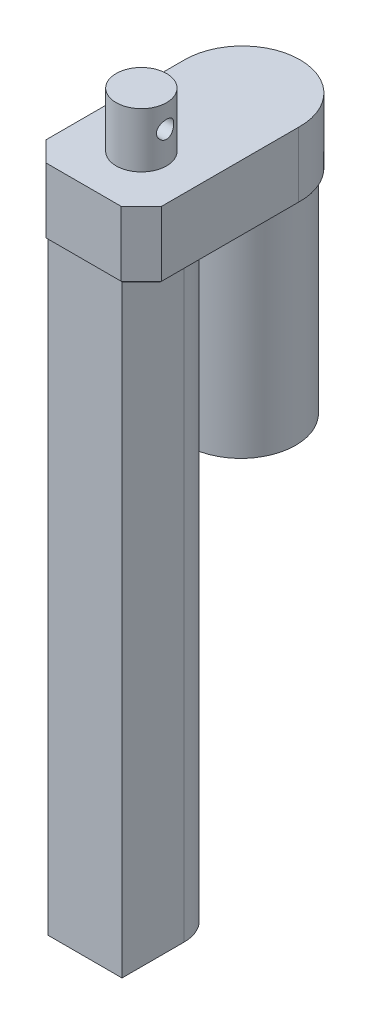
ISO-10303-21;
HEADER;
FILE_DESCRIPTION(('STEP AP214'),'2;1');
FILE_NAME('part.step','',(''),(''),'','','');
FILE_SCHEMA(('AUTOMOTIVE_DESIGN { 1 0 10303 214 1 1 1 1 }'));
ENDSEC;
DATA;
#1=APPLICATION_CONTEXT('core data for automotive mechanical design processes');
#2=APPLICATION_PROTOCOL_DEFINITION('international standard','automotive_design',2000,#1);
#3=PRODUCT_CONTEXT('',#1,'mechanical');
#4=PRODUCT('Part','Part','',(#3));
#5=PRODUCT_RELATED_PRODUCT_CATEGORY('part','',(#4));
#6=PRODUCT_DEFINITION_FORMATION('','',#4);
#7=PRODUCT_DEFINITION_CONTEXT('part definition',#1,'design');
#8=PRODUCT_DEFINITION('design','',#6,#7);
#9=PRODUCT_DEFINITION_SHAPE('','',#8);
#10=(LENGTH_UNIT() NAMED_UNIT(*) SI_UNIT(.MILLI.,.METRE.));
#11=(NAMED_UNIT(*) PLANE_ANGLE_UNIT() SI_UNIT($,.RADIAN.));
#12=(NAMED_UNIT(*) SI_UNIT($,.STERADIAN.) SOLID_ANGLE_UNIT());
#13=UNCERTAINTY_MEASURE_WITH_UNIT(LENGTH_MEASURE(1.E-05),#10,'distance_accuracy_value','');
#14=(GEOMETRIC_REPRESENTATION_CONTEXT(3) GLOBAL_UNCERTAINTY_ASSIGNED_CONTEXT((#13)) GLOBAL_UNIT_ASSIGNED_CONTEXT((#10,
#11,#12)) REPRESENTATION_CONTEXT('',''));
#15=CARTESIAN_POINT('',(0.,0.,0.));
#16=DIRECTION('',(0.,0.,1.));
#17=DIRECTION('',(1.,0.,0.));
#18=AXIS2_PLACEMENT_3D('',#15,#16,#17);
#19=CARTESIAN_POINT('',(0.,0.,-27.7439024390244));
#20=DIRECTION('',(0.,1.,0.));
#21=DIRECTION('',(0.,0.,1.));
#22=AXIS2_PLACEMENT_3D('',#19,#20,#21);
#23=PLANE('',#22);
#24=CARTESIAN_POINT('',(0.,0.,-27.25));
#25=DIRECTION('',(0.,1.,0.));
#26=DIRECTION('',(0.,0.,1.));
#27=AXIS2_PLACEMENT_3D('',#24,#25,#26);
#28=CIRCLE('',#27,19.);
#29=CARTESIAN_POINT('',(0.,0.,-8.25));
#30=VERTEX_POINT('',#29);
#31=EDGE_CURVE('E11',#30,#30,#28,.F.);
#32=ORIENTED_EDGE('',*,*,#31,.F.);
#33=EDGE_LOOP('',(#32));
#34=FACE_BOUND('',#33,.T.);
#35=DIRECTION('',(0.,0.,-1.));
#36=VECTOR('',#35,1.);
#37=CARTESIAN_POINT('',(-12.7928932188134,0.,0.));
#38=LINE('',#37,#36);
#39=CARTESIAN_POINT('',(-12.7928932188134,0.,26.75));
#40=VERTEX_POINT('',#39);
#41=CARTESIAN_POINT('',(-12.7928932188134,0.,5.25));
#42=VERTEX_POINT('',#41);
#43=EDGE_CURVE('E160',#40,#42,#38,.T.);
#44=ORIENTED_EDGE('',*,*,#43,.F.);
#45=DIRECTION('',(-0.707106781186546,0.,-0.707106781186549));
#46=VECTOR('',#45,1.);
#47=CARTESIAN_POINT('',(-19.6464466094067,0.,19.8964466094067));
#48=LINE('',#47,#46);
#49=CARTESIAN_POINT('',(-19.5,0.,20.0428932188134));
#50=VERTEX_POINT('',#49);
#51=EDGE_CURVE('E242',#40,#50,#48,.T.);
#52=ORIENTED_EDGE('',*,*,#51,.T.);
#53=DIRECTION('',(0.,0.,-1.));
#54=VECTOR('',#53,1.);
#55=CARTESIAN_POINT('',(-19.5,0.,-27.7439024390244));
#56=LINE('',#55,#54);
#57=CARTESIAN_POINT('',(-19.5,0.,-27.256211903645));
#58=VERTEX_POINT('',#57);
#59=EDGE_CURVE('E245',#50,#58,#56,.T.);
#60=ORIENTED_EDGE('',*,*,#59,.T.);
#61=CARTESIAN_POINT('',(0.,0.,-27.7439024390244));
#62=DIRECTION('',(0.,1.,0.));
#63=DIRECTION('',(0.,0.,1.));
#64=AXIS2_PLACEMENT_3D('',#61,#62,#63);
#65=CIRCLE('',#64,19.5060975609756);
#66=CARTESIAN_POINT('',(19.5,0.,-27.256211903645));
#67=VERTEX_POINT('',#66);
#68=EDGE_CURVE('E248',#58,#67,#65,.F.);
#69=ORIENTED_EDGE('',*,*,#68,.T.);
#70=DIRECTION('',(0.,0.,1.));
#71=VECTOR('',#70,1.);
#72=CARTESIAN_POINT('',(19.5,0.,-27.7439024390244));
#73=LINE('',#72,#71);
#74=CARTESIAN_POINT('',(19.5,0.,20.0428932188135));
#75=VERTEX_POINT('',#74);
#76=EDGE_CURVE('E232',#67,#75,#73,.T.);
#77=ORIENTED_EDGE('',*,*,#76,.T.);
#78=DIRECTION('',(-0.707106781186549,0.,0.707106781186546));
#79=VECTOR('',#78,1.);
#80=CARTESIAN_POINT('',(12.6464466094067,0.,26.8964466094067));
#81=LINE('',#80,#79);
#82=CARTESIAN_POINT('',(12.7928932188134,0.,26.75));
#83=VERTEX_POINT('',#82);
#84=EDGE_CURVE('E235',#75,#83,#81,.T.);
#85=ORIENTED_EDGE('',*,*,#84,.T.);
#86=DIRECTION('',(0.,0.,1.));
#87=VECTOR('',#86,1.);
#88=CARTESIAN_POINT('',(12.7928932188134,0.,0.));
#89=LINE('',#88,#87);
#90=CARTESIAN_POINT('',(12.7928932188134,0.,5.25));
#91=VERTEX_POINT('',#90);
#92=EDGE_CURVE('E69',#91,#83,#89,.T.);
#93=ORIENTED_EDGE('',*,*,#92,.F.);
#94=CARTESIAN_POINT('',(0.,0.,5.25));
#95=DIRECTION('',(0.,-1.,0.));
#96=DIRECTION('',(0.,0.,-1.));
#97=AXIS2_PLACEMENT_3D('',#94,#95,#96);
#98=CIRCLE('',#97,12.7928932188134);
#99=EDGE_CURVE('E64',#42,#91,#98,.T.);
#100=ORIENTED_EDGE('',*,*,#99,.F.);
#101=EDGE_LOOP('',(#44,#52,#60,#69,#77,#85,#93,#100));
#102=FACE_BOUND('',#101,.T.);
#103=ADVANCED_FACE('F41',(#34,#102),#23,.F.);
#104=CARTESIAN_POINT('',(0.,23.,-27.7439024390244));
#105=DIRECTION('',(0.,-1.,0.));
#106=DIRECTION('',(0.,0.,-1.));
#107=AXIS2_PLACEMENT_3D('',#104,#105,#106);
#108=CYLINDRICAL_SURFACE('',#107,20.0060975609756);
#109=DIRECTION('',(0.,-1.,0.));
#110=VECTOR('',#109,1.);
#111=CARTESIAN_POINT('',(20.,23.,-27.25));
#112=LINE('',#111,#110);
#113=CARTESIAN_POINT('',(20.,23.,-27.25));
#114=VERTEX_POINT('',#113);
#115=CARTESIAN_POINT('',(20.,0.5,-27.25));
#116=VERTEX_POINT('',#115);
#117=EDGE_CURVE('E200',#114,#116,#112,.T.);
#118=ORIENTED_EDGE('',*,*,#117,.T.);
#119=CARTESIAN_POINT('',(0.,0.5,-27.7439024390244));
#120=DIRECTION('',(0.,1.,0.));
#121=DIRECTION('',(0.,0.,1.));
#122=AXIS2_PLACEMENT_3D('',#119,#120,#121);
#123=CIRCLE('',#122,20.0060975609756);
#124=CARTESIAN_POINT('',(-20.,0.5,-27.25));
#125=VERTEX_POINT('',#124);
#126=EDGE_CURVE('E228',#116,#125,#123,.T.);
#127=ORIENTED_EDGE('',*,*,#126,.T.);
#128=DIRECTION('',(0.,-1.,0.));
#129=VECTOR('',#128,1.);
#130=CARTESIAN_POINT('',(-20.,23.,-27.25));
#131=LINE('',#130,#129);
#132=CARTESIAN_POINT('',(-20.,23.,-27.25));
#133=VERTEX_POINT('',#132);
#134=EDGE_CURVE('E204',#133,#125,#131,.T.);
#135=ORIENTED_EDGE('',*,*,#134,.F.);
#136=CARTESIAN_POINT('',(0.,23.,-27.7439024390244));
#137=DIRECTION('',(0.,1.,0.));
#138=DIRECTION('',(0.,0.,1.));
#139=AXIS2_PLACEMENT_3D('',#136,#137,#138);
#140=CIRCLE('',#139,20.0060975609756);
#141=EDGE_CURVE('E180',#114,#133,#140,.T.);
#142=ORIENTED_EDGE('',*,*,#141,.F.);
#143=EDGE_LOOP('',(#118,#127,#135,#142));
#144=FACE_BOUND('',#143,.T.);
#145=ADVANCED_FACE('F306',(#144),#108,.T.);
#146=CARTESIAN_POINT('',(-20.,23.,27.25));
#147=DIRECTION('',(1.,0.,0.));
#148=DIRECTION('',(0.,0.,-1.));
#149=AXIS2_PLACEMENT_3D('',#146,#147,#148);
#150=PLANE('',#149);
#151=ORIENTED_EDGE('',*,*,#134,.T.);
#152=DIRECTION('',(0.,0.,1.));
#153=VECTOR('',#152,1.);
#154=CARTESIAN_POINT('',(-20.,0.5,27.25));
#155=LINE('',#154,#153);
#156=CARTESIAN_POINT('',(-20.,0.5,20.25));
#157=VERTEX_POINT('',#156);
#158=EDGE_CURVE('E252',#125,#157,#155,.T.);
#159=ORIENTED_EDGE('',*,*,#158,.T.);
#160=DIRECTION('',(0.,1.,0.));
#161=VECTOR('',#160,1.);
#162=CARTESIAN_POINT('',(-20.,23.,20.25));
#163=LINE('',#162,#161);
#164=CARTESIAN_POINT('',(-20.,23.,20.25));
#165=VERTEX_POINT('',#164);
#166=EDGE_CURVE('E225',#157,#165,#163,.T.);
#167=ORIENTED_EDGE('',*,*,#166,.T.);
#168=DIRECTION('',(0.,0.,1.));
#169=VECTOR('',#168,1.);
#170=CARTESIAN_POINT('',(-20.,23.,27.25));
#171=LINE('',#170,#169);
#172=EDGE_CURVE('E189',#133,#165,#171,.T.);
#173=ORIENTED_EDGE('',*,*,#172,.F.);
#174=EDGE_LOOP('',(#151,#159,#167,#173));
#175=FACE_BOUND('',#174,.T.);
#176=ADVANCED_FACE('F312',(#175),#150,.F.);
#177=CARTESIAN_POINT('',(-20.,23.,27.25));
#178=DIRECTION('',(0.,0.,-1.));
#179=DIRECTION('',(-1.,0.,0.));
#180=AXIS2_PLACEMENT_3D('',#177,#178,#179);
#181=PLANE('',#180);
#182=DIRECTION('',(0.,-1.,0.));
#183=VECTOR('',#182,1.);
#184=CARTESIAN_POINT('',(-13.,23.,27.25));
#185=LINE('',#184,#183);
#186=CARTESIAN_POINT('',(-13.,23.,27.25));
#187=VERTEX_POINT('',#186);
#188=CARTESIAN_POINT('',(-13.,0.5,27.25));
#189=VERTEX_POINT('',#188);
#190=EDGE_CURVE('E212',#187,#189,#185,.T.);
#191=ORIENTED_EDGE('',*,*,#190,.T.);
#192=DIRECTION('',(1.,0.,0.));
#193=VECTOR('',#192,1.);
#194=CARTESIAN_POINT('',(-20.,0.5,27.25));
#195=LINE('',#194,#193);
#196=CARTESIAN_POINT('',(13.,0.5,27.25));
#197=VERTEX_POINT('',#196);
#198=EDGE_CURVE('E258',#189,#197,#195,.T.);
#199=ORIENTED_EDGE('',*,*,#198,.T.);
#200=DIRECTION('',(0.,1.,0.));
#201=VECTOR('',#200,1.);
#202=CARTESIAN_POINT('',(13.,23.,27.25));
#203=LINE('',#202,#201);
#204=CARTESIAN_POINT('',(13.,23.,27.25));
#205=VERTEX_POINT('',#204);
#206=EDGE_CURVE('E216',#197,#205,#203,.T.);
#207=ORIENTED_EDGE('',*,*,#206,.T.);
#208=DIRECTION('',(1.,0.,0.));
#209=VECTOR('',#208,1.);
#210=CARTESIAN_POINT('',(-20.,23.,27.25));
#211=LINE('',#210,#209);
#212=EDGE_CURVE('E193',#187,#205,#211,.T.);
#213=ORIENTED_EDGE('',*,*,#212,.F.);
#214=EDGE_LOOP('',(#191,#199,#207,#213));
#215=FACE_BOUND('',#214,.T.);
#216=ADVANCED_FACE('F322',(#215),#181,.F.);
#217=CARTESIAN_POINT('',(20.,23.,27.25));
#218=DIRECTION('',(-1.,0.,0.));
#219=DIRECTION('',(0.,0.,1.));
#220=AXIS2_PLACEMENT_3D('',#217,#218,#219);
#221=PLANE('',#220);
#222=DIRECTION('',(0.,-1.,0.));
#223=VECTOR('',#222,1.);
#224=CARTESIAN_POINT('',(20.,23.,20.25));
#225=LINE('',#224,#223);
#226=CARTESIAN_POINT('',(20.,23.,20.25));
#227=VERTEX_POINT('',#226);
#228=CARTESIAN_POINT('',(20.,0.5,20.25));
#229=VERTEX_POINT('',#228);
#230=EDGE_CURVE('E208',#227,#229,#225,.T.);
#231=ORIENTED_EDGE('',*,*,#230,.T.);
#232=DIRECTION('',(0.,0.,-1.));
#233=VECTOR('',#232,1.);
#234=CARTESIAN_POINT('',(20.,0.5,27.25));
#235=LINE('',#234,#233);
#236=EDGE_CURVE('E56',#229,#116,#235,.T.);
#237=ORIENTED_EDGE('',*,*,#236,.T.);
#238=ORIENTED_EDGE('',*,*,#117,.F.);
#239=DIRECTION('',(0.,0.,-1.));
#240=VECTOR('',#239,1.);
#241=CARTESIAN_POINT('',(20.,23.,27.25));
#242=LINE('',#241,#240);
#243=EDGE_CURVE('E197',#227,#114,#242,.T.);
#244=ORIENTED_EDGE('',*,*,#243,.F.);
#245=EDGE_LOOP('',(#231,#237,#238,#244));
#246=FACE_BOUND('',#245,.T.);
#247=ADVANCED_FACE('F319',(#246),#221,.F.);
#248=CARTESIAN_POINT('',(0.,23.,-27.7439024390244));
#249=DIRECTION('',(0.,1.,0.));
#250=DIRECTION('',(0.,0.,1.));
#251=AXIS2_PLACEMENT_3D('',#248,#249,#250);
#252=PLANE('',#251);
#253=CARTESIAN_POINT('',(0.,23.,7.25));
#254=DIRECTION('',(0.,1.,0.));
#255=DIRECTION('',(0.,0.,1.));
#256=AXIS2_PLACEMENT_3D('',#253,#254,#255);
#257=CIRCLE('',#256,8.75);
#258=CARTESIAN_POINT('',(0.,23.,16.));
#259=VERTEX_POINT('',#258);
#260=EDGE_CURVE('E181',#259,#259,#257,.T.);
#261=ORIENTED_EDGE('',*,*,#260,.F.);
#262=EDGE_LOOP('',(#261));
#263=FACE_BOUND('',#262,.T.);
#264=ORIENTED_EDGE('',*,*,#212,.T.);
#265=DIRECTION('',(-0.707106781186549,0.,0.707106781186546));
#266=VECTOR('',#265,1.);
#267=CARTESIAN_POINT('',(33.9969512195122,23.,6.25304878048787));
#268=LINE('',#267,#266);
#269=EDGE_CURVE('E222',#205,#227,#268,.F.);
#270=ORIENTED_EDGE('',*,*,#269,.T.);
#271=ORIENTED_EDGE('',*,*,#243,.T.);
#272=ORIENTED_EDGE('',*,*,#141,.T.);
#273=ORIENTED_EDGE('',*,*,#172,.T.);
#274=DIRECTION('',(-0.707106781186546,0.,-0.707106781186549));
#275=VECTOR('',#274,1.);
#276=CARTESIAN_POINT('',(-33.9969512195122,23.,6.25304878048772));
#277=LINE('',#276,#275);
#278=EDGE_CURVE('E219',#165,#187,#277,.F.);
#279=ORIENTED_EDGE('',*,*,#278,.T.);
#280=EDGE_LOOP('',(#264,#270,#271,#272,#273,#279));
#281=FACE_BOUND('',#280,.T.);
#282=ADVANCED_FACE('F318',(#263,#281),#252,.T.);
#283=CARTESIAN_POINT('',(20.,23.,20.25));
#284=DIRECTION('',(-0.707106781186546,0.,-0.707106781186549));
#285=DIRECTION('',(0.,-1.,0.));
#286=AXIS2_PLACEMENT_3D('',#283,#284,#285);
#287=PLANE('',#286);
#288=ORIENTED_EDGE('',*,*,#206,.F.);
#289=DIRECTION('',(-0.707106781186549,0.,0.707106781186546));
#290=VECTOR('',#289,1.);
#291=CARTESIAN_POINT('',(20.,0.5,20.25));
#292=LINE('',#291,#290);
#293=EDGE_CURVE('E261',#197,#229,#292,.F.);
#294=ORIENTED_EDGE('',*,*,#293,.T.);
#295=ORIENTED_EDGE('',*,*,#230,.F.);
#296=ORIENTED_EDGE('',*,*,#269,.F.);
#297=EDGE_LOOP('',(#288,#294,#295,#296));
#298=FACE_BOUND('',#297,.T.);
#299=ADVANCED_FACE('F330',(#298),#287,.F.);
#300=CARTESIAN_POINT('',(-13.,23.,27.25));
#301=DIRECTION('',(0.707106781186549,0.,-0.707106781186546));
#302=DIRECTION('',(0.,-1.,0.));
#303=AXIS2_PLACEMENT_3D('',#300,#301,#302);
#304=PLANE('',#303);
#305=ORIENTED_EDGE('',*,*,#166,.F.);
#306=DIRECTION('',(-0.707106781186546,0.,-0.707106781186549));
#307=VECTOR('',#306,1.);
#308=CARTESIAN_POINT('',(-13.,0.500000000000001,27.25));
#309=LINE('',#308,#307);
#310=EDGE_CURVE('E255',#157,#189,#309,.F.);
#311=ORIENTED_EDGE('',*,*,#310,.T.);
#312=ORIENTED_EDGE('',*,*,#190,.F.);
#313=ORIENTED_EDGE('',*,*,#278,.F.);
#314=EDGE_LOOP('',(#305,#311,#312,#313));
#315=FACE_BOUND('',#314,.T.);
#316=ADVANCED_FACE('F332',(#315),#304,.F.);
#317=CARTESIAN_POINT('',(0.,42.,7.25));
#318=DIRECTION('',(0.,-1.,0.));
#319=DIRECTION('',(0.,0.,-1.));
#320=AXIS2_PLACEMENT_3D('',#317,#318,#319);
#321=CYLINDRICAL_SURFACE('',#320,8.75);
#322=CARTESIAN_POINT('',(-8.2196411113868,34.,4.25));
#323=CARTESIAN_POINT('',(-8.21963966696499,34.1631026677264,4.24999821199337));
#324=CARTESIAN_POINT('',(-8.22454879313556,34.3261930090845,4.26334607855193));
#325=CARTESIAN_POINT('',(-8.24354529034157,34.6475229389937,4.31619133361418));
#326=CARTESIAN_POINT('',(-8.25763374103735,34.8057619546453,4.35569179816168));
#327=CARTESIAN_POINT('',(-8.29320953916202,35.1126783509252,4.45927637699315));
#328=CARTESIAN_POINT('',(-8.31468169000744,35.2613746316122,4.52331002955212));
#329=CARTESIAN_POINT('',(-8.36258290594314,35.5459647520904,4.67396938643779));
#330=CARTESIAN_POINT('',(-8.38901316058877,35.6818555077828,4.76060051433486));
#331=CARTESIAN_POINT('',(-8.44508015335536,35.942606039379,4.95783961590905));
#332=CARTESIAN_POINT('',(-8.47480011343842,36.0668585110533,5.0692269904548));
#333=CARTESIAN_POINT('',(-8.53339647944575,36.2953371918525,5.31115547250579));
#334=CARTESIAN_POINT('',(-8.56227274016146,36.3995599706962,5.4416998540969));
#335=CARTESIAN_POINT('',(-8.61689727547401,36.5878130452084,5.72271457310106));
#336=CARTESIAN_POINT('',(-8.64253634317682,36.6712018148212,5.87363778054657));
#337=CARTESIAN_POINT('',(-8.68681281914156,36.8111646786476,6.18840043871628));
#338=CARTESIAN_POINT('',(-8.70545223081177,36.8677464466486,6.35223617740962));
#339=CARTESIAN_POINT('',(-8.73303950244701,36.9504144080879,6.68180185040079));
#340=CARTESIAN_POINT('',(-8.74231746635867,36.9775420898004,6.84724238566389));
#341=CARTESIAN_POINT('',(-8.7513110578293,37.0038489637629,7.18057007356003));
#342=CARTESIAN_POINT('',(-8.75102928980447,37.0030357681162,7.34845654737247));
#343=CARTESIAN_POINT('',(-8.74115588060926,36.9741327793623,7.67451840318935));
#344=CARTESIAN_POINT('',(-8.73195074331423,36.947175366136,7.83280780717064));
#345=CARTESIAN_POINT('',(-8.70575489999197,36.8686288000134,8.14246230437054));
#346=CARTESIAN_POINT('',(-8.68876365908347,36.8170379548663,8.2938269210918));
#347=CARTESIAN_POINT('',(-8.64842501286197,36.6900584980084,8.58774682084455));
#348=CARTESIAN_POINT('',(-8.62499479354297,36.6143576296963,8.7301553676012));
#349=CARTESIAN_POINT('',(-8.57420241941931,36.4415680779828,9.00057446449465));
#350=CARTESIAN_POINT('',(-8.54683912884594,36.3444732122198,9.12858083655643));
#351=CARTESIAN_POINT('',(-8.48944850567277,36.1259988728825,9.3732864729827));
#352=CARTESIAN_POINT('',(-8.45935635609438,36.0036533413404,9.48910931619769));
#353=CARTESIAN_POINT('',(-8.40103160366621,35.7410338478009,9.69888789551482));
#354=CARTESIAN_POINT('',(-8.37279932364301,35.6007567857005,9.79283984251247));
#355=CARTESIAN_POINT('',(-8.32102377112971,35.3033322988642,9.95751950566393));
#356=CARTESIAN_POINT('',(-8.2975619198116,35.1459527022397,10.0278554782275));
#357=CARTESIAN_POINT('',(-8.25892402122806,34.8205738756784,10.1407222309304));
#358=CARTESIAN_POINT('',(-8.24374425888971,34.6525794450036,10.1832654796652));
#359=CARTESIAN_POINT('',(-8.22423759406534,34.319270193321,10.2375093937651));
#360=CARTESIAN_POINT('',(-8.21943030120823,34.1542059006265,10.2505766127404));
#361=CARTESIAN_POINT('',(-8.21986609325329,33.8242081805408,10.249384558195));
#362=CARTESIAN_POINT('',(-8.22510721427078,33.6592747338794,10.2351306243822));
#363=CARTESIAN_POINT('',(-8.24456830823428,33.3406032709185,10.1809315627575));
#364=CARTESIAN_POINT('',(-8.25844819778452,33.1866768929378,10.1419584952316));
#365=CARTESIAN_POINT('',(-8.29324232389215,32.8875871163843,10.0406061457153));
#366=CARTESIAN_POINT('',(-8.3141578521977,32.7424253327738,9.97822256529509));
#367=CARTESIAN_POINT('',(-8.36152229337208,32.4596592391811,9.82947906160251));
#368=CARTESIAN_POINT('',(-8.38813137799001,32.3224638408889,9.74239419482448));
#369=CARTESIAN_POINT('',(-8.44358342820308,32.064141171528,9.54753030073554));
#370=CARTESIAN_POINT('',(-8.47242708698829,31.9430189183965,9.43974483640611));
#371=CARTESIAN_POINT('',(-8.5308903700107,31.7138442880211,9.19996900691919));
#372=CARTESIAN_POINT('',(-8.56047373735717,31.6067829763372,9.06701964834227));
#373=CARTESIAN_POINT('',(-8.61563093416445,31.4164136636205,8.78431267120997));
#374=CARTESIAN_POINT('',(-8.64120487981175,31.3331049742183,8.63455553993225));
#375=CARTESIAN_POINT('',(-8.68535987286581,31.1933362112036,8.32311716911724));
#376=CARTESIAN_POINT('',(-8.70398280844663,31.1367147529628,8.16151461612874));
#377=CARTESIAN_POINT('',(-8.73231423186321,31.0517059044869,7.83031163558396));
#378=CARTESIAN_POINT('',(-8.74202614581118,31.0233076626317,7.66071430825193));
#379=CARTESIAN_POINT('',(-8.75116789234191,30.9965720145565,7.32737571744395));
#380=CARTESIAN_POINT('',(-8.75108311611696,30.9968155225997,7.16376039845709));
#381=CARTESIAN_POINT('',(-8.74185154282233,31.023823058207,6.83901025845031));
#382=CARTESIAN_POINT('',(-8.73270555403372,31.0505847202907,6.67787521748582));
#383=CARTESIAN_POINT('',(-8.70656769128771,31.1289125222774,6.36550014016176));
#384=CARTESIAN_POINT('',(-8.68971687054434,31.1800333957826,6.21413579640993));
#385=CARTESIAN_POINT('',(-8.64990647437029,31.3052102418289,5.92208285407036));
#386=CARTESIAN_POINT('',(-8.62694577482648,31.379270435224,5.78139622612738));
#387=CARTESIAN_POINT('',(-8.5761737217924,31.5514762670169,5.50882064815411));
#388=CARTESIAN_POINT('',(-8.54821044613054,31.6504346856282,5.37747390102216));
#389=CARTESIAN_POINT('',(-8.49092159348734,31.8682685540706,5.13279185270617));
#390=CARTESIAN_POINT('',(-8.46159557157982,31.9871505422868,5.01946248821678));
#391=CARTESIAN_POINT('',(-8.40340801901877,32.2474316909771,4.80916985898143));
#392=CARTESIAN_POINT('',(-8.37461796951372,32.3895678964295,4.71309601680038));
#393=CARTESIAN_POINT('',(-8.32225317575394,32.688873264318,4.5462462043968));
#394=CARTESIAN_POINT('',(-8.29867745126572,32.8460395932918,4.4754654778148));
#395=CARTESIAN_POINT('',(-8.26025973071726,33.1668972288271,4.36312123829911));
#396=CARTESIAN_POINT('',(-8.24520703193571,33.3303134963923,4.32084741203481));
#397=CARTESIAN_POINT('',(-8.22490043606385,33.662492356516,4.26429333610913));
#398=CARTESIAN_POINT('',(-8.21964260579627,33.831252775407,4.25000184988486));
#399=CARTESIAN_POINT('',(-8.2196411113868,34.,4.25));
#400=B_SPLINE_CURVE_WITH_KNOTS('',3,(#322,#323,#324,#325,#326,#327,#328,#329,#330,#331,#332,
#333,#334,#335,#336,#337,#338,#339,#340,#341,#342,#343,#344,#345,#346,#347,#348,#349,#350,#351,
#352,#353,#354,#355,#356,#357,#358,#359,#360,#361,#362,#363,#364,#365,#366,#367,#368,#369,#370,
#371,#372,#373,#374,#375,#376,#377,#378,#379,#380,#381,#382,#383,#384,#385,#386,#387,#388,#389,
#390,#391,#392,#393,#394,#395,#396,#397,#398,#399),.UNSPECIFIED.,.T.,.F.,(4,2,2,2,2,2,2,2,2,2,2,
2,2,2,2,2,2,2,2,2,2,2,2,2,2,2,2,2,2,2,2,2,2,2,2,2,2,2,4),(0.,0.488682337219747,
0.977422163006771,1.46516206218575,1.95301913062753,2.45922932278978,2.9655261313039,
3.48589073327405,4.00610628524081,4.5072593455663,5.00827587479767,5.48851853048441,
5.96879418230657,6.45556189842432,6.9424704638653,7.4535433316787,7.96470467641856,
8.48396864418949,9.00299949530807,9.4974244192431,9.99175272150508,10.4677544221134,
10.9438435647083,11.4356834532261,11.9276765317009,12.4449440528246,12.9621965816088,
13.4762796922962,13.9901650652326,14.4786007186933,14.966992806489,15.446781266494,
15.9266580604689,16.4248866674341,16.9232791010886,17.4426450771838,17.9619133352713,
18.467710839701,18.9733051948578),.UNSPECIFIED.);
#401=CARTESIAN_POINT('',(-8.2196411113868,34.,4.25));
#402=VERTEX_POINT('',#401);
#403=EDGE_CURVE('E45',#402,#402,#400,.T.);
#404=ORIENTED_EDGE('',*,*,#403,.T.);
#405=EDGE_LOOP('',(#404));
#406=FACE_BOUND('',#405,.T.);
#407=CARTESIAN_POINT('',(8.2196411113868,34.,4.25));
#408=CARTESIAN_POINT('',(8.21963966696499,33.8368973322736,4.24999821199337));
#409=CARTESIAN_POINT('',(8.22454879313556,33.6738069909155,4.26334607855193));
#410=CARTESIAN_POINT('',(8.24354529034157,33.3524770610063,4.31619133361418));
#411=CARTESIAN_POINT('',(8.25763374103735,33.1942380453547,4.35569179816168));
#412=CARTESIAN_POINT('',(8.29320953916202,32.8873216490748,4.45927637699315));
#413=CARTESIAN_POINT('',(8.31468169000744,32.7386253683878,4.52331002955212));
#414=CARTESIAN_POINT('',(8.36258290594314,32.4540352479096,4.67396938643779));
#415=CARTESIAN_POINT('',(8.38901316058877,32.3181444922172,4.76060051433486));
#416=CARTESIAN_POINT('',(8.44508015335536,32.057393960621,4.95783961590905));
#417=CARTESIAN_POINT('',(8.47480011343842,31.9331414889467,5.0692269904548));
#418=CARTESIAN_POINT('',(8.53339647944575,31.7046628081475,5.31115547250579));
#419=CARTESIAN_POINT('',(8.56227274016146,31.6004400293038,5.4416998540969));
#420=CARTESIAN_POINT('',(8.61689727547401,31.4121869547916,5.72271457310106));
#421=CARTESIAN_POINT('',(8.64253634317682,31.3287981851788,5.87363778054657));
#422=CARTESIAN_POINT('',(8.68681281914156,31.1888353213524,6.18840043871628));
#423=CARTESIAN_POINT('',(8.70545223081177,31.1322535533514,6.35223617740962));
#424=CARTESIAN_POINT('',(8.73303950244701,31.0495855919121,6.68180185040079));
#425=CARTESIAN_POINT('',(8.74231746635867,31.0224579101996,6.84724238566389));
#426=CARTESIAN_POINT('',(8.7513110578293,30.996151036237,7.18057007356003));
#427=CARTESIAN_POINT('',(8.75102928980447,30.9969642318838,7.34845654737247));
#428=CARTESIAN_POINT('',(8.74115588060926,31.0258672206377,7.67451840318935));
#429=CARTESIAN_POINT('',(8.73195074331423,31.052824633864,7.83280780717064));
#430=CARTESIAN_POINT('',(8.70575489999197,31.1313711999866,8.14246230437054));
#431=CARTESIAN_POINT('',(8.68876365908347,31.1829620451337,8.2938269210918));
#432=CARTESIAN_POINT('',(8.64842501286197,31.3099415019915,8.58774682084455));
#433=CARTESIAN_POINT('',(8.62499479354297,31.3856423703037,8.7301553676012));
#434=CARTESIAN_POINT('',(8.57420241941931,31.5584319220172,9.00057446449465));
#435=CARTESIAN_POINT('',(8.54683912884594,31.6555267877801,9.12858083655643));
#436=CARTESIAN_POINT('',(8.48944850567277,31.8740011271175,9.3732864729827));
#437=CARTESIAN_POINT('',(8.45935635609438,31.9963466586595,9.48910931619769));
#438=CARTESIAN_POINT('',(8.40103160366621,32.2589661521991,9.69888789551482));
#439=CARTESIAN_POINT('',(8.372799323643,32.3992432142995,9.79283984251248));
#440=CARTESIAN_POINT('',(8.32102377112971,32.6966677011358,9.95751950566393));
#441=CARTESIAN_POINT('',(8.2975619198116,32.8540472977603,10.0278554782275));
#442=CARTESIAN_POINT('',(8.25892402122806,33.1794261243216,10.1407222309304));
#443=CARTESIAN_POINT('',(8.24374425888971,33.3474205549964,10.1832654796652));
#444=CARTESIAN_POINT('',(8.22423759406534,33.680729806679,10.2375093937651));
#445=CARTESIAN_POINT('',(8.21943030120823,33.8457940993735,10.2505766127404));
#446=CARTESIAN_POINT('',(8.21986609325329,34.1757918194592,10.249384558195));
#447=CARTESIAN_POINT('',(8.22510721427078,34.3407252661206,10.2351306243822));
#448=CARTESIAN_POINT('',(8.24456830823428,34.6593967290815,10.1809315627575));
#449=CARTESIAN_POINT('',(8.25844819778452,34.8133231070622,10.1419584952316));
#450=CARTESIAN_POINT('',(8.29324232389215,35.1124128836157,10.0406061457153));
#451=CARTESIAN_POINT('',(8.3141578521977,35.2575746672262,9.97822256529509));
#452=CARTESIAN_POINT('',(8.36152229337208,35.5403407608189,9.82947906160251));
#453=CARTESIAN_POINT('',(8.38813137799001,35.6775361591111,9.74239419482448));
#454=CARTESIAN_POINT('',(8.44358342820307,35.935858828472,9.54753030073555));
#455=CARTESIAN_POINT('',(8.47242708698829,36.0569810816035,9.43974483640611));
#456=CARTESIAN_POINT('',(8.5308903700107,36.2861557119789,9.19996900691919));
#457=CARTESIAN_POINT('',(8.56047373735717,36.3932170236628,9.06701964834227));
#458=CARTESIAN_POINT('',(8.61563093416445,36.5835863363795,8.78431267120997));
#459=CARTESIAN_POINT('',(8.64120487981175,36.6668950257817,8.63455553993225));
#460=CARTESIAN_POINT('',(8.68535987286581,36.8066637887964,8.32311716911724));
#461=CARTESIAN_POINT('',(8.70398280844663,36.8632852470372,8.16151461612873));
#462=CARTESIAN_POINT('',(8.73231423186321,36.9482940955131,7.83031163558395));
#463=CARTESIAN_POINT('',(8.74202614581118,36.9766923373683,7.66071430825192));
#464=CARTESIAN_POINT('',(8.75116789234191,37.0034279854435,7.32737571744395));
#465=CARTESIAN_POINT('',(8.75108311611696,37.0031844774003,7.16376039845709));
#466=CARTESIAN_POINT('',(8.74185154282233,36.976176941793,6.83901025845031));
#467=CARTESIAN_POINT('',(8.73270555403372,36.9494152797093,6.67787521748582));
#468=CARTESIAN_POINT('',(8.70656769128771,36.8710874777226,6.36550014016176));
#469=CARTESIAN_POINT('',(8.68971687054434,36.8199666042174,6.21413579640993));
#470=CARTESIAN_POINT('',(8.64990647437029,36.6947897581711,5.92208285407036));
#471=CARTESIAN_POINT('',(8.62694577482648,36.620729564776,5.78139622612737));
#472=CARTESIAN_POINT('',(8.5761737217924,36.4485237329831,5.5088206481541));
#473=CARTESIAN_POINT('',(8.54821044613054,36.3495653143718,5.37747390102216));
#474=CARTESIAN_POINT('',(8.49092159348735,36.1317314459294,5.13279185270617));
#475=CARTESIAN_POINT('',(8.46159557157982,36.0128494577132,5.01946248821678));
#476=CARTESIAN_POINT('',(8.40340801901877,35.7525683090229,4.80916985898143));
#477=CARTESIAN_POINT('',(8.37461796951372,35.6104321035704,4.71309601680038));
#478=CARTESIAN_POINT('',(8.32225317575394,35.311126735682,4.5462462043968));
#479=CARTESIAN_POINT('',(8.29867745126572,35.1539604067082,4.4754654778148));
#480=CARTESIAN_POINT('',(8.26025973071726,34.8331027711729,4.36312123829911));
#481=CARTESIAN_POINT('',(8.24520703193571,34.6696865036077,4.32084741203481));
#482=CARTESIAN_POINT('',(8.22490043606385,34.337507643484,4.26429333610913));
#483=CARTESIAN_POINT('',(8.21964260579627,34.168747224593,4.25000184988486));
#484=CARTESIAN_POINT('',(8.2196411113868,34.,4.25));
#485=B_SPLINE_CURVE_WITH_KNOTS('',3,(#407,#408,#409,#410,#411,#412,#413,#414,#415,#416,#417,
#418,#419,#420,#421,#422,#423,#424,#425,#426,#427,#428,#429,#430,#431,#432,#433,#434,#435,#436,
#437,#438,#439,#440,#441,#442,#443,#444,#445,#446,#447,#448,#449,#450,#451,#452,#453,#454,#455,
#456,#457,#458,#459,#460,#461,#462,#463,#464,#465,#466,#467,#468,#469,#470,#471,#472,#473,#474,
#475,#476,#477,#478,#479,#480,#481,#482,#483,#484),.UNSPECIFIED.,.T.,.F.,(4,2,2,2,2,2,2,2,2,2,2,
2,2,2,2,2,2,2,2,2,2,2,2,2,2,2,2,2,2,2,2,2,2,2,2,2,2,2,4),(0.,0.488682337219747,
0.977422163006771,1.46516206218575,1.95301913062753,2.45922932278978,2.9655261313039,
3.48589073327405,4.00610628524081,4.5072593455663,5.00827587479767,5.48851853048441,
5.96879418230657,6.45556189842433,6.9424704638653,7.4535433316787,7.96470467641856,
8.48396864418949,9.00299949530807,9.4974244192431,9.99175272150508,10.4677544221134,
10.9438435647083,11.4356834532261,11.9276765317009,12.4449440528246,12.9621965816088,
13.4762796922962,13.9901650652326,14.4786007186933,14.966992806489,15.446781266494,
15.9266580604689,16.4248866674341,16.9232791010886,17.4426450771838,17.9619133352713,
18.467710839701,18.9733051948578),.UNSPECIFIED.);
#486=CARTESIAN_POINT('',(8.2196411113868,34.,4.25));
#487=VERTEX_POINT('',#486);
#488=EDGE_CURVE('E162',#487,#487,#485,.T.);
#489=ORIENTED_EDGE('',*,*,#488,.T.);
#490=EDGE_LOOP('',(#489));
#491=FACE_BOUND('',#490,.T.);
#492=CARTESIAN_POINT('',(0.,42.,7.25));
#493=DIRECTION('',(0.,1.,0.));
#494=DIRECTION('',(0.,0.,1.));
#495=AXIS2_PLACEMENT_3D('',#492,#493,#494);
#496=CIRCLE('',#495,8.75);
#497=CARTESIAN_POINT('',(0.,42.,16.));
#498=VERTEX_POINT('',#497);
#499=EDGE_CURVE('E176',#498,#498,#496,.T.);
#500=ORIENTED_EDGE('',*,*,#499,.F.);
#501=EDGE_LOOP('',(#500));
#502=FACE_BOUND('',#501,.T.);
#503=ORIENTED_EDGE('',*,*,#260,.T.);
#504=EDGE_LOOP('',(#503));
#505=FACE_BOUND('',#504,.T.);
#506=ADVANCED_FACE('F335',(#406,#491,#502,#505),#321,.T.);
#507=CARTESIAN_POINT('',(0.,42.,7.25));
#508=DIRECTION('',(0.,1.,0.));
#509=DIRECTION('',(0.,0.,1.));
#510=AXIS2_PLACEMENT_3D('',#507,#508,#509);
#511=PLANE('',#510);
#512=ORIENTED_EDGE('',*,*,#499,.T.);
#513=EDGE_LOOP('',(#512));
#514=FACE_BOUND('',#513,.T.);
#515=ADVANCED_FACE('F302',(#514),#511,.T.);
#516=CARTESIAN_POINT('',(-20.,0.5,27.25));
#517=DIRECTION('',(0.,0.707106781186547,-0.707106781186547));
#518=DIRECTION('',(1.,0.,0.));
#519=AXIS2_PLACEMENT_3D('',#516,#517,#518);
#520=PLANE('',#519);
#521=DIRECTION('',(0.281084637714824,-0.678598344545846,-0.678598344545846));
#522=VECTOR('',#521,1.);
#523=CARTESIAN_POINT('',(-13.5530600149149,1.83520498881384,28.5852049888138));
#524=LINE('',#523,#522);
#525=EDGE_CURVE('E351',#40,#189,#524,.F.);
#526=ORIENTED_EDGE('',*,*,#525,.F.);
#527=DIRECTION('',(-1.,0.,0.));
#528=VECTOR('',#527,1.);
#529=CARTESIAN_POINT('',(0.,0.,26.75));
#530=LINE('',#529,#528);
#531=EDGE_CURVE('E238',#83,#40,#530,.T.);
#532=ORIENTED_EDGE('',*,*,#531,.F.);
#533=DIRECTION('',(-0.281084637714817,-0.678598344545848,-0.678598344545848));
#534=VECTOR('',#533,1.);
#535=CARTESIAN_POINT('',(10.4631621639491,-5.62446830933527,21.1255316906647));
#536=LINE('',#535,#534);
#537=EDGE_CURVE('E185',#197,#83,#536,.T.);
#538=ORIENTED_EDGE('',*,*,#537,.F.);
#539=ORIENTED_EDGE('',*,*,#198,.F.);
#540=EDGE_LOOP('',(#526,#532,#538,#539));
#541=FACE_BOUND('',#540,.T.);
#542=ADVANCED_FACE('F43',(#541),#520,.F.);
#543=CARTESIAN_POINT('',(33.6433978289189,0.,5.8994953898946));
#544=DIRECTION('',(-0.5,0.707106781186546,-0.500000000000002));
#545=DIRECTION('',(-0.707106781186549,0.,0.707106781186546));
#546=AXIS2_PLACEMENT_3D('',#543,#544,#545);
#547=PLANE('',#546);
#548=ORIENTED_EDGE('',*,*,#537,.T.);
#549=ORIENTED_EDGE('',*,*,#84,.F.);
#550=DIRECTION('',(-0.678598344545848,-0.678598344545848,-0.281084637714818));
#551=VECTOR('',#550,1.);
#552=CARTESIAN_POINT('',(21.3352049888138,1.83520498881381,20.8030600149149));
#553=LINE('',#552,#551);
#554=EDGE_CURVE('E355',#229,#75,#553,.T.);
#555=ORIENTED_EDGE('',*,*,#554,.F.);
#556=ORIENTED_EDGE('',*,*,#293,.F.);
#557=EDGE_LOOP('',(#548,#549,#555,#556));
#558=FACE_BOUND('',#557,.T.);
#559=ADVANCED_FACE('F295',(#558),#547,.F.);
#560=CARTESIAN_POINT('',(-33.6433978289189,0.,5.89949538989444));
#561=DIRECTION('',(0.5,0.707106781186549,-0.499999999999998));
#562=DIRECTION('',(-0.707106781186546,0.,-0.707106781186549));
#563=AXIS2_PLACEMENT_3D('',#560,#561,#562);
#564=PLANE('',#563);
#565=ORIENTED_EDGE('',*,*,#525,.T.);
#566=ORIENTED_EDGE('',*,*,#310,.F.);
#567=DIRECTION('',(0.678598344545847,-0.678598344545847,-0.281084637714823));
#568=VECTOR('',#567,1.);
#569=CARTESIAN_POINT('',(-23.3152118791657,3.81521187916574,21.6232057224908));
#570=LINE('',#569,#568);
#571=EDGE_CURVE('E348',#50,#157,#570,.F.);
#572=ORIENTED_EDGE('',*,*,#571,.F.);
#573=ORIENTED_EDGE('',*,*,#51,.F.);
#574=EDGE_LOOP('',(#565,#566,#572,#573));
#575=FACE_BOUND('',#574,.T.);
#576=ADVANCED_FACE('F292',(#575),#564,.F.);
#577=CARTESIAN_POINT('',(20.,0.5,27.25));
#578=DIRECTION('',(-0.707106781186547,0.707106781186547,0.));
#579=DIRECTION('',(0.,0.,-1.));
#580=AXIS2_PLACEMENT_3D('',#577,#578,#579);
#581=PLANE('',#580);
#582=ORIENTED_EDGE('',*,*,#554,.T.);
#583=ORIENTED_EDGE('',*,*,#76,.F.);
#584=CARTESIAN_POINT('',(19.5,0.,-27.256211903645));
#585=CARTESIAN_POINT('',(19.5833332926376,0.0833332926375673,-27.2551700349844));
#586=CARTESIAN_POINT('',(19.6666666056234,0.166666605623425,-27.2541314420171));
#587=CARTESIAN_POINT('',(19.8333332722901,0.333333272290092,-27.2520608074687));
#588=CARTESIAN_POINT('',(19.9166666259709,0.416666625970901,-27.2510287658878));
#589=CARTESIAN_POINT('',(20.,0.500000000000001,-27.25));
#590=B_SPLINE_CURVE_WITH_KNOTS('',3,(#584,#585,#586,#587,#588,#589),.UNSPECIFIED.,.F.,.F.,(4,2,
4),(0.,0.353567033298845,0.707134066590779),.UNSPECIFIED.);
#591=EDGE_CURVE('E274',#116,#67,#590,.F.);
#592=ORIENTED_EDGE('',*,*,#591,.F.);
#593=ORIENTED_EDGE('',*,*,#236,.F.);
#594=EDGE_LOOP('',(#582,#583,#592,#593));
#595=FACE_BOUND('',#594,.T.);
#596=ADVANCED_FACE('F287',(#595),#581,.F.);
#597=CARTESIAN_POINT('',(-20.,0.5,27.25));
#598=DIRECTION('',(0.707106781186547,0.707106781186547,0.));
#599=DIRECTION('',(0.,0.,1.));
#600=AXIS2_PLACEMENT_3D('',#597,#598,#599);
#601=PLANE('',#600);
#602=ORIENTED_EDGE('',*,*,#571,.T.);
#603=ORIENTED_EDGE('',*,*,#158,.F.);
#604=CARTESIAN_POINT('',(-20.,0.5,-27.25));
#605=CARTESIAN_POINT('',(-19.9166666259709,0.416666625970901,-27.2510287658878));
#606=CARTESIAN_POINT('',(-19.8333332722901,0.333333272290092,-27.2520608074688));
#607=CARTESIAN_POINT('',(-19.6666666056234,0.166666605623425,-27.2541314420171));
#608=CARTESIAN_POINT('',(-19.5833332926376,0.083333292637567,-27.2551700349845));
#609=CARTESIAN_POINT('',(-19.5,0.,-27.256211903645));
#610=B_SPLINE_CURVE_WITH_KNOTS('',3,(#604,#605,#606,#607,#608,#609),.UNSPECIFIED.,.F.,.F.,(4,2,
4),(0.,0.353567033291933,0.707134066590779),.UNSPECIFIED.);
#611=EDGE_CURVE('E175',#58,#125,#610,.F.);
#612=ORIENTED_EDGE('',*,*,#611,.F.);
#613=ORIENTED_EDGE('',*,*,#59,.F.);
#614=EDGE_LOOP('',(#602,#603,#612,#613));
#615=FACE_BOUND('',#614,.T.);
#616=ADVANCED_FACE('F284',(#615),#601,.F.);
#617=CARTESIAN_POINT('',(0.,0.5,-27.7439024390244));
#618=DIRECTION('',(0.,1.,0.));
#619=DIRECTION('',(0.,0.,1.));
#620=AXIS2_PLACEMENT_3D('',#617,#618,#619);
#621=CONICAL_SURFACE('',#620,20.0060975609756,0.785398163397448);
#622=ORIENTED_EDGE('',*,*,#591,.T.);
#623=ORIENTED_EDGE('',*,*,#68,.F.);
#624=ORIENTED_EDGE('',*,*,#611,.T.);
#625=ORIENTED_EDGE('',*,*,#126,.F.);
#626=EDGE_LOOP('',(#622,#623,#624,#625));
#627=FACE_BOUND('',#626,.T.);
#628=ADVANCED_FACE('F281',(#627),#621,.T.);
#629=CARTESIAN_POINT('',(0.,-73.,-27.25));
#630=DIRECTION('',(0.,1.,0.));
#631=DIRECTION('',(0.,0.,1.));
#632=AXIS2_PLACEMENT_3D('',#629,#630,#631);
#633=CYLINDRICAL_SURFACE('',#632,19.);
#634=CARTESIAN_POINT('',(0.,-73.,-27.25));
#635=DIRECTION('',(0.,-1.,0.));
#636=DIRECTION('',(0.,0.,-1.));
#637=AXIS2_PLACEMENT_3D('',#634,#635,#636);
#638=CIRCLE('',#637,19.);
#639=CARTESIAN_POINT('',(0.,-73.,-46.25));
#640=VERTEX_POINT('',#639);
#641=EDGE_CURVE('E171',#640,#640,#638,.T.);
#642=ORIENTED_EDGE('',*,*,#641,.F.);
#643=EDGE_LOOP('',(#642));
#644=FACE_BOUND('',#643,.T.);
#645=ORIENTED_EDGE('',*,*,#31,.T.);
#646=EDGE_LOOP('',(#645));
#647=FACE_BOUND('',#646,.T.);
#648=ADVANCED_FACE('F380',(#644,#647),#633,.T.);
#649=CARTESIAN_POINT('',(0.,-73.,-27.25));
#650=DIRECTION('',(0.,-1.,0.));
#651=DIRECTION('',(0.,0.,-1.));
#652=AXIS2_PLACEMENT_3D('',#649,#650,#651);
#653=PLANE('',#652);
#654=ORIENTED_EDGE('',*,*,#641,.T.);
#655=EDGE_LOOP('',(#654));
#656=FACE_BOUND('',#655,.T.);
#657=ADVANCED_FACE('F374',(#656),#653,.T.);
#658=CARTESIAN_POINT('',(-12.5,34.,7.25));
#659=DIRECTION('',(1.,0.,0.));
#660=DIRECTION('',(0.,0.,-1.));
#661=AXIS2_PLACEMENT_3D('',#658,#659,#660);
#662=CYLINDRICAL_SURFACE('',#661,3.);
#663=ORIENTED_EDGE('',*,*,#488,.F.);
#664=EDGE_LOOP('',(#663));
#665=FACE_BOUND('',#664,.T.);
#666=ORIENTED_EDGE('',*,*,#403,.F.);
#667=EDGE_LOOP('',(#666));
#668=FACE_BOUND('',#667,.T.);
#669=ADVANCED_FACE('F369',(#665,#668),#662,.F.);
#670=CARTESIAN_POINT('',(-12.7928932188134,-209.,0.));
#671=DIRECTION('',(1.,0.,0.));
#672=DIRECTION('',(0.,0.,-1.));
#673=AXIS2_PLACEMENT_3D('',#670,#671,#672);
#674=PLANE('',#673);
#675=ORIENTED_EDGE('',*,*,#43,.T.);
#676=DIRECTION('',(0.,1.,0.));
#677=VECTOR('',#676,1.);
#678=CARTESIAN_POINT('',(-12.7928932188134,-209.,5.25));
#679=LINE('',#678,#677);
#680=CARTESIAN_POINT('',(-12.7928932188134,-209.,5.25));
#681=VERTEX_POINT('',#680);
#682=EDGE_CURVE('E140',#681,#42,#679,.T.);
#683=ORIENTED_EDGE('',*,*,#682,.F.);
#684=DIRECTION('',(0.,0.,-1.));
#685=VECTOR('',#684,1.);
#686=CARTESIAN_POINT('',(-12.7928932188134,-209.,0.));
#687=LINE('',#686,#685);
#688=CARTESIAN_POINT('',(-12.7928932188134,-209.,26.75));
#689=VERTEX_POINT('',#688);
#690=EDGE_CURVE('E148',#689,#681,#687,.T.);
#691=ORIENTED_EDGE('',*,*,#690,.F.);
#692=DIRECTION('',(0.,1.,0.));
#693=VECTOR('',#692,1.);
#694=CARTESIAN_POINT('',(-12.7928932188134,-209.,26.75));
#695=LINE('',#694,#693);
#696=EDGE_CURVE('E424',#689,#40,#695,.T.);
#697=ORIENTED_EDGE('',*,*,#696,.T.);
#698=EDGE_LOOP('',(#675,#683,#691,#697));
#699=FACE_BOUND('',#698,.T.);
#700=ADVANCED_FACE('F159',(#699),#674,.F.);
#701=CARTESIAN_POINT('',(0.,-209.,5.25));
#702=DIRECTION('',(0.,1.,0.));
#703=DIRECTION('',(0.,0.,1.));
#704=AXIS2_PLACEMENT_3D('',#701,#702,#703);
#705=CYLINDRICAL_SURFACE('',#704,12.7928932188134);
#706=ORIENTED_EDGE('',*,*,#99,.T.);
#707=DIRECTION('',(0.,1.,0.));
#708=VECTOR('',#707,1.);
#709=CARTESIAN_POINT('',(12.7928932188134,-209.,5.25));
#710=LINE('',#709,#708);
#711=CARTESIAN_POINT('',(12.7928932188134,-209.,5.25));
#712=VERTEX_POINT('',#711);
#713=EDGE_CURVE('E143',#712,#91,#710,.T.);
#714=ORIENTED_EDGE('',*,*,#713,.F.);
#715=CARTESIAN_POINT('',(0.,-209.,5.25));
#716=DIRECTION('',(0.,-1.,0.));
#717=DIRECTION('',(0.,0.,-1.));
#718=AXIS2_PLACEMENT_3D('',#715,#716,#717);
#719=CIRCLE('',#718,12.7928932188134);
#720=EDGE_CURVE('E136',#681,#712,#719,.T.);
#721=ORIENTED_EDGE('',*,*,#720,.F.);
#722=ORIENTED_EDGE('',*,*,#682,.T.);
#723=EDGE_LOOP('',(#706,#714,#721,#722));
#724=FACE_BOUND('',#723,.T.);
#725=ADVANCED_FACE('F138',(#724),#705,.T.);
#726=CARTESIAN_POINT('',(12.7928932188134,-209.,0.));
#727=DIRECTION('',(-1.,0.,0.));
#728=DIRECTION('',(0.,0.,1.));
#729=AXIS2_PLACEMENT_3D('',#726,#727,#728);
#730=PLANE('',#729);
#731=ORIENTED_EDGE('',*,*,#92,.T.);
#732=DIRECTION('',(0.,1.,0.));
#733=VECTOR('',#732,1.);
#734=CARTESIAN_POINT('',(12.7928932188134,-209.,26.75));
#735=LINE('',#734,#733);
#736=CARTESIAN_POINT('',(12.7928932188134,-209.,26.75));
#737=VERTEX_POINT('',#736);
#738=EDGE_CURVE('E167',#737,#83,#735,.T.);
#739=ORIENTED_EDGE('',*,*,#738,.F.);
#740=DIRECTION('',(0.,0.,1.));
#741=VECTOR('',#740,1.);
#742=CARTESIAN_POINT('',(12.7928932188134,-209.,0.));
#743=LINE('',#742,#741);
#744=EDGE_CURVE('E147',#712,#737,#743,.T.);
#745=ORIENTED_EDGE('',*,*,#744,.F.);
#746=ORIENTED_EDGE('',*,*,#713,.T.);
#747=EDGE_LOOP('',(#731,#739,#745,#746));
#748=FACE_BOUND('',#747,.T.);
#749=ADVANCED_FACE('F418',(#748),#730,.F.);
#750=CARTESIAN_POINT('',(0.,-209.,26.75));
#751=DIRECTION('',(0.,0.,-1.));
#752=DIRECTION('',(-1.,0.,0.));
#753=AXIS2_PLACEMENT_3D('',#750,#751,#752);
#754=PLANE('',#753);
#755=ORIENTED_EDGE('',*,*,#531,.T.);
#756=ORIENTED_EDGE('',*,*,#696,.F.);
#757=DIRECTION('',(-1.,0.,0.));
#758=VECTOR('',#757,1.);
#759=CARTESIAN_POINT('',(0.,-209.,26.75));
#760=LINE('',#759,#758);
#761=EDGE_CURVE('E153',#737,#689,#760,.T.);
#762=ORIENTED_EDGE('',*,*,#761,.F.);
#763=ORIENTED_EDGE('',*,*,#738,.T.);
#764=EDGE_LOOP('',(#755,#756,#762,#763));
#765=FACE_BOUND('',#764,.T.);
#766=ADVANCED_FACE('F422',(#765),#754,.F.);
#767=CARTESIAN_POINT('',(0.,-209.,0.));
#768=DIRECTION('',(0.,-1.,0.));
#769=DIRECTION('',(0.,0.,-1.));
#770=AXIS2_PLACEMENT_3D('',#767,#768,#769);
#771=PLANE('',#770);
#772=CARTESIAN_POINT('',(0.,-209.,7.25));
#773=DIRECTION('',(0.,-1.,0.));
#774=DIRECTION('',(0.,0.,-1.));
#775=AXIS2_PLACEMENT_3D('',#772,#773,#774);
#776=CIRCLE('',#775,10.);
#777=CARTESIAN_POINT('',(0.,-209.,-2.75));
#778=VERTEX_POINT('',#777);
#779=EDGE_CURVE('E437',#778,#778,#776,.T.);
#780=ORIENTED_EDGE('',*,*,#779,.F.);
#781=EDGE_LOOP('',(#780));
#782=FACE_BOUND('',#781,.T.);
#783=ORIENTED_EDGE('',*,*,#690,.T.);
#784=ORIENTED_EDGE('',*,*,#720,.T.);
#785=ORIENTED_EDGE('',*,*,#744,.T.);
#786=ORIENTED_EDGE('',*,*,#761,.T.);
#787=EDGE_LOOP('',(#783,#784,#785,#786));
#788=FACE_BOUND('',#787,.T.);
#789=ADVANCED_FACE('F151',(#782,#788),#771,.T.);
#790=CARTESIAN_POINT('',(0.,-59.,7.25));
#791=DIRECTION('',(0.,-1.,0.));
#792=DIRECTION('',(0.,0.,-1.));
#793=AXIS2_PLACEMENT_3D('',#790,#791,#792);
#794=CYLINDRICAL_SURFACE('',#793,10.);
#795=CARTESIAN_POINT('',(0.,-59.,7.25));
#796=DIRECTION('',(0.,-1.,0.));
#797=DIRECTION('',(0.,0.,-1.));
#798=AXIS2_PLACEMENT_3D('',#795,#796,#797);
#799=CIRCLE('',#798,10.);
#800=CARTESIAN_POINT('',(0.,-59.,-2.75));
#801=VERTEX_POINT('',#800);
#802=EDGE_CURVE('E432',#801,#801,#799,.T.);
#803=ORIENTED_EDGE('',*,*,#802,.F.);
#804=EDGE_LOOP('',(#803));
#805=FACE_BOUND('',#804,.T.);
#806=ORIENTED_EDGE('',*,*,#779,.T.);
#807=EDGE_LOOP('',(#806));
#808=FACE_BOUND('',#807,.T.);
#809=ADVANCED_FACE('F447',(#805,#808),#794,.F.);
#810=CARTESIAN_POINT('',(0.,-59.,7.25));
#811=DIRECTION('',(0.,-1.,0.));
#812=DIRECTION('',(0.,0.,-1.));
#813=AXIS2_PLACEMENT_3D('',#810,#811,#812);
#814=PLANE('',#813);
#815=ORIENTED_EDGE('',*,*,#802,.T.);
#816=EDGE_LOOP('',(#815));
#817=FACE_BOUND('',#816,.T.);
#818=ADVANCED_FACE('F445',(#817),#814,.T.);
#819=CLOSED_SHELL('',(#103,#145,#176,#216,#247,#282,#299,#316,#506,#515,#542,#559,#576,#596,
#616,#628,#648,#657,#669,#700,#725,#749,#766,#789,#809,#818));
#820=MANIFOLD_SOLID_BREP('B2',#819);
#821=ADVANCED_BREP_SHAPE_REPRESENTATION('',(#18,#820),#14);
#822=SHAPE_DEFINITION_REPRESENTATION(#9,#821);
ENDSEC;
END-ISO-10303-21;
